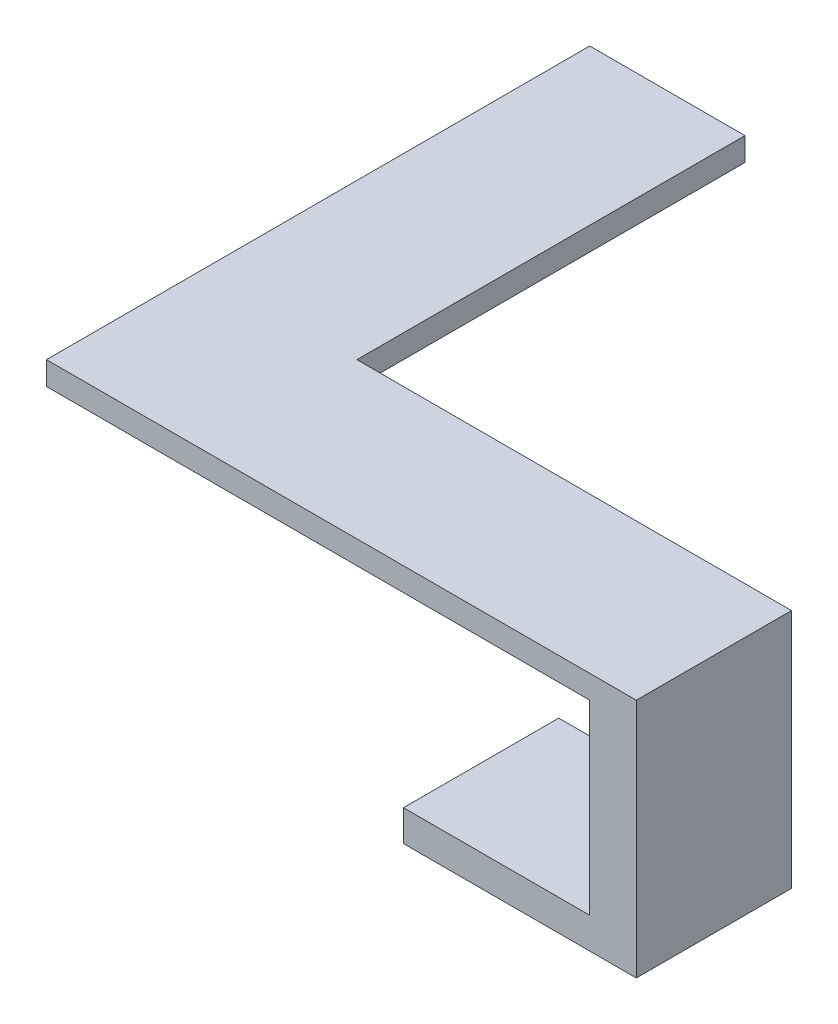
ISO-10303-21;
HEADER;
FILE_DESCRIPTION(('STEP AP214'),'2;1');
FILE_NAME('part.step','',(''),(''),'','','');
FILE_SCHEMA(('AUTOMOTIVE_DESIGN { 1 0 10303 214 1 1 1 1 }'));
ENDSEC;
DATA;
#1=APPLICATION_CONTEXT('core data for automotive mechanical design processes');
#2=APPLICATION_PROTOCOL_DEFINITION('international standard','automotive_design',2000,#1);
#3=PRODUCT_CONTEXT('',#1,'mechanical');
#4=PRODUCT('Part','Part','',(#3));
#5=PRODUCT_RELATED_PRODUCT_CATEGORY('part','',(#4));
#6=PRODUCT_DEFINITION_FORMATION('','',#4);
#7=PRODUCT_DEFINITION_CONTEXT('part definition',#1,'design');
#8=PRODUCT_DEFINITION('design','',#6,#7);
#9=PRODUCT_DEFINITION_SHAPE('','',#8);
#10=(LENGTH_UNIT() NAMED_UNIT(*) SI_UNIT(.MILLI.,.METRE.));
#11=(NAMED_UNIT(*) PLANE_ANGLE_UNIT() SI_UNIT($,.RADIAN.));
#12=(NAMED_UNIT(*) SI_UNIT($,.STERADIAN.) SOLID_ANGLE_UNIT());
#13=UNCERTAINTY_MEASURE_WITH_UNIT(LENGTH_MEASURE(1.E-05),#10,'distance_accuracy_value','');
#14=(GEOMETRIC_REPRESENTATION_CONTEXT(3) GLOBAL_UNCERTAINTY_ASSIGNED_CONTEXT((#13)) GLOBAL_UNIT_ASSIGNED_CONTEXT((#10,
#11,#12)) REPRESENTATION_CONTEXT('',''));
#15=CARTESIAN_POINT('',(0.,0.,0.));
#16=DIRECTION('',(0.,0.,1.));
#17=DIRECTION('',(1.,0.,0.));
#18=AXIS2_PLACEMENT_3D('',#15,#16,#17);
#19=CARTESIAN_POINT('',(14.4710053420667,-14.,6.23964476502383));
#20=DIRECTION('',(1.,0.,0.));
#21=DIRECTION('',(0.,0.,-1.));
#22=AXIS2_PLACEMENT_3D('',#19,#20,#21);
#23=PLANE('',#22);
#24=DIRECTION('',(0.,0.,-1.));
#25=VECTOR('',#24,1.);
#26=CARTESIAN_POINT('',(14.4710053420667,-12.,-3.76035523497617));
#27=LINE('',#26,#25);
#28=CARTESIAN_POINT('',(14.4710053420667,-12.,6.23964476502383));
#29=VERTEX_POINT('',#28);
#30=CARTESIAN_POINT('',(14.4710053420667,-12.,-3.76035523497617));
#31=VERTEX_POINT('',#30);
#32=EDGE_CURVE('E178',#29,#31,#27,.T.);
#33=ORIENTED_EDGE('',*,*,#32,.F.);
#34=DIRECTION('',(0.,1.,0.));
#35=VECTOR('',#34,1.);
#36=CARTESIAN_POINT('',(14.4710053420667,-14.,6.23964476502383));
#37=LINE('',#36,#35);
#38=CARTESIAN_POINT('',(14.4710053420667,0.,6.23964476502383));
#39=VERTEX_POINT('',#38);
#40=EDGE_CURVE('E48',#29,#39,#37,.T.);
#41=ORIENTED_EDGE('',*,*,#40,.T.);
#42=DIRECTION('',(0.,0.,-1.));
#43=VECTOR('',#42,1.);
#44=CARTESIAN_POINT('',(14.4710053420667,0.,6.23964476502383));
#45=LINE('',#44,#43);
#46=CARTESIAN_POINT('',(14.4710053420667,0.,-3.76035523497617));
#47=VERTEX_POINT('',#46);
#48=EDGE_CURVE('E142',#39,#47,#45,.T.);
#49=ORIENTED_EDGE('',*,*,#48,.T.);
#50=DIRECTION('',(0.,1.,0.));
#51=VECTOR('',#50,1.);
#52=CARTESIAN_POINT('',(14.4710053420667,-14.,-3.76035523497617));
#53=LINE('',#52,#51);
#54=EDGE_CURVE('E161',#31,#47,#53,.T.);
#55=ORIENTED_EDGE('',*,*,#54,.F.);
#56=EDGE_LOOP('',(#33,#41,#49,#55));
#57=FACE_BOUND('',#56,.T.);
#58=ADVANCED_FACE('F33',(#57),#23,.F.);
#59=CARTESIAN_POINT('',(17.4710053420667,1.5,6.23964476502383));
#60=DIRECTION('',(-1.,0.,0.));
#61=DIRECTION('',(0.,0.,1.));
#62=AXIS2_PLACEMENT_3D('',#59,#60,#61);
#63=PLANE('',#62);
#64=DIRECTION('',(0.,-1.,0.));
#65=VECTOR('',#64,1.);
#66=CARTESIAN_POINT('',(17.4710053420667,1.5,6.23964476502383));
#67=LINE('',#66,#65);
#68=CARTESIAN_POINT('',(17.4710053420667,1.5,6.23964476502383));
#69=VERTEX_POINT('',#68);
#70=CARTESIAN_POINT('',(17.4710053420667,-14.,6.23964476502383));
#71=VERTEX_POINT('',#70);
#72=EDGE_CURVE('E117',#69,#71,#67,.T.);
#73=ORIENTED_EDGE('',*,*,#72,.T.);
#74=DIRECTION('',(0.,0.,1.));
#75=VECTOR('',#74,1.);
#76=CARTESIAN_POINT('',(17.4710053420667,-14.,6.23964476502383));
#77=LINE('',#76,#75);
#78=CARTESIAN_POINT('',(17.4710053420667,-14.,-3.76035523497617));
#79=VERTEX_POINT('',#78);
#80=EDGE_CURVE('E166',#79,#71,#77,.T.);
#81=ORIENTED_EDGE('',*,*,#80,.F.);
#82=DIRECTION('',(0.,-1.,0.));
#83=VECTOR('',#82,1.);
#84=CARTESIAN_POINT('',(17.4710053420667,1.5,-3.76035523497617));
#85=LINE('',#84,#83);
#86=CARTESIAN_POINT('',(17.4710053420667,1.5,-3.76035523497617));
#87=VERTEX_POINT('',#86);
#88=EDGE_CURVE('E11',#87,#79,#85,.T.);
#89=ORIENTED_EDGE('',*,*,#88,.F.);
#90=DIRECTION('',(0.,0.,-1.));
#91=VECTOR('',#90,1.);
#92=CARTESIAN_POINT('',(17.4710053420667,1.5,6.23964476502383));
#93=LINE('',#92,#91);
#94=EDGE_CURVE('E130',#69,#87,#93,.T.);
#95=ORIENTED_EDGE('',*,*,#94,.F.);
#96=EDGE_LOOP('',(#73,#81,#89,#95));
#97=FACE_BOUND('',#96,.T.);
#98=ADVANCED_FACE('F35',(#97),#63,.F.);
#99=CARTESIAN_POINT('',(-10.5289946579333,1.5,-3.76035523497617));
#100=DIRECTION('',(0.,0.,1.));
#101=DIRECTION('',(1.,0.,0.));
#102=AXIS2_PLACEMENT_3D('',#99,#100,#101);
#103=PLANE('',#102);
#104=ORIENTED_EDGE('',*,*,#88,.T.);
#105=DIRECTION('',(1.,0.,0.));
#106=VECTOR('',#105,1.);
#107=CARTESIAN_POINT('',(17.4710053420667,-14.,-3.76035523497617));
#108=LINE('',#107,#106);
#109=CARTESIAN_POINT('',(2.47100534206673,-14.,-3.76035523497617));
#110=VERTEX_POINT('',#109);
#111=EDGE_CURVE('E164',#110,#79,#108,.T.);
#112=ORIENTED_EDGE('',*,*,#111,.F.);
#113=DIRECTION('',(0.,-1.,0.));
#114=VECTOR('',#113,1.);
#115=CARTESIAN_POINT('',(2.47100534206673,-14.,-3.76035523497617));
#116=LINE('',#115,#114);
#117=CARTESIAN_POINT('',(2.47100534206673,-12.,-3.76035523497617));
#118=VERTEX_POINT('',#117);
#119=EDGE_CURVE('E181',#118,#110,#116,.T.);
#120=ORIENTED_EDGE('',*,*,#119,.F.);
#121=DIRECTION('',(1.,0.,0.));
#122=VECTOR('',#121,1.);
#123=CARTESIAN_POINT('',(2.47100534206673,-12.,-3.76035523497617));
#124=LINE('',#123,#122);
#125=EDGE_CURVE('E174',#118,#31,#124,.T.);
#126=ORIENTED_EDGE('',*,*,#125,.T.);
#127=ORIENTED_EDGE('',*,*,#54,.T.);
#128=DIRECTION('',(-1.,0.,0.));
#129=VECTOR('',#128,1.);
#130=CARTESIAN_POINT('',(-10.5289946579333,0.,-3.76035523497617));
#131=LINE('',#130,#129);
#132=CARTESIAN_POINT('',(-10.5289946579333,0.,-3.76035523497617));
#133=VERTEX_POINT('',#132);
#134=EDGE_CURVE('E121',#47,#133,#131,.T.);
#135=ORIENTED_EDGE('',*,*,#134,.T.);
#136=DIRECTION('',(0.,-1.,0.));
#137=VECTOR('',#136,1.);
#138=CARTESIAN_POINT('',(-10.5289946579333,1.5,-3.76035523497617));
#139=LINE('',#138,#137);
#140=CARTESIAN_POINT('',(-10.5289946579333,1.5,-3.76035523497617));
#141=VERTEX_POINT('',#140);
#142=EDGE_CURVE('E41',#141,#133,#139,.T.);
#143=ORIENTED_EDGE('',*,*,#142,.F.);
#144=DIRECTION('',(-1.,0.,0.));
#145=VECTOR('',#144,1.);
#146=CARTESIAN_POINT('',(-10.5289946579333,1.5,-3.76035523497617));
#147=LINE('',#146,#145);
#148=EDGE_CURVE('E87',#87,#141,#147,.T.);
#149=ORIENTED_EDGE('',*,*,#148,.F.);
#150=EDGE_LOOP('',(#104,#112,#120,#126,#127,#135,#143,#149));
#151=FACE_BOUND('',#150,.T.);
#152=ADVANCED_FACE('F203',(#151),#103,.F.);
#153=CARTESIAN_POINT('',(-10.5289946579333,1.5,-3.76035523497617));
#154=DIRECTION('',(-1.,0.,0.));
#155=DIRECTION('',(0.,0.,1.));
#156=AXIS2_PLACEMENT_3D('',#153,#154,#155);
#157=PLANE('',#156);
#158=DIRECTION('',(0.,0.,-1.));
#159=VECTOR('',#158,1.);
#160=CARTESIAN_POINT('',(-10.5289946579333,0.,-3.76035523497617));
#161=LINE('',#160,#159);
#162=CARTESIAN_POINT('',(-10.528994657933,0.,-28.7603552349762));
#163=VERTEX_POINT('',#162);
#164=EDGE_CURVE('E123',#133,#163,#161,.T.);
#165=ORIENTED_EDGE('',*,*,#164,.T.);
#166=DIRECTION('',(0.,-1.,0.));
#167=VECTOR('',#166,1.);
#168=CARTESIAN_POINT('',(-10.528994657933,1.5,-28.7603552349762));
#169=LINE('',#168,#167);
#170=CARTESIAN_POINT('',(-10.528994657933,1.5,-28.7603552349762));
#171=VERTEX_POINT('',#170);
#172=EDGE_CURVE('E112',#171,#163,#169,.T.);
#173=ORIENTED_EDGE('',*,*,#172,.F.);
#174=DIRECTION('',(0.,0.,-1.));
#175=VECTOR('',#174,1.);
#176=CARTESIAN_POINT('',(-10.5289946579333,1.5,-3.76035523497617));
#177=LINE('',#176,#175);
#178=EDGE_CURVE('E103',#141,#171,#177,.T.);
#179=ORIENTED_EDGE('',*,*,#178,.F.);
#180=ORIENTED_EDGE('',*,*,#142,.T.);
#181=EDGE_LOOP('',(#165,#173,#179,#180));
#182=FACE_BOUND('',#181,.T.);
#183=ADVANCED_FACE('F137',(#182),#157,.F.);
#184=CARTESIAN_POINT('',(-10.528994657933,1.5,-28.7603552349762));
#185=DIRECTION('',(0.,0.,1.));
#186=DIRECTION('',(1.,0.,0.));
#187=AXIS2_PLACEMENT_3D('',#184,#185,#186);
#188=PLANE('',#187);
#189=DIRECTION('',(-1.,0.,0.));
#190=VECTOR('',#189,1.);
#191=CARTESIAN_POINT('',(-10.528994657933,0.,-28.7603552349762));
#192=LINE('',#191,#190);
#193=CARTESIAN_POINT('',(-20.528994657933,0.,-28.7603552349763));
#194=VERTEX_POINT('',#193);
#195=EDGE_CURVE('E111',#163,#194,#192,.T.);
#196=ORIENTED_EDGE('',*,*,#195,.T.);
#197=DIRECTION('',(0.,-1.,0.));
#198=VECTOR('',#197,1.);
#199=CARTESIAN_POINT('',(-20.528994657933,1.5,-28.7603552349763));
#200=LINE('',#199,#198);
#201=CARTESIAN_POINT('',(-20.528994657933,1.5,-28.7603552349763));
#202=VERTEX_POINT('',#201);
#203=EDGE_CURVE('E108',#202,#194,#200,.T.);
#204=ORIENTED_EDGE('',*,*,#203,.F.);
#205=DIRECTION('',(-1.,0.,0.));
#206=VECTOR('',#205,1.);
#207=CARTESIAN_POINT('',(-10.528994657933,1.5,-28.7603552349762));
#208=LINE('',#207,#206);
#209=EDGE_CURVE('E97',#171,#202,#208,.T.);
#210=ORIENTED_EDGE('',*,*,#209,.F.);
#211=ORIENTED_EDGE('',*,*,#172,.T.);
#212=EDGE_LOOP('',(#196,#204,#210,#211));
#213=FACE_BOUND('',#212,.T.);
#214=ADVANCED_FACE('F109',(#213),#188,.F.);
#215=CARTESIAN_POINT('',(-20.528994657933,1.5,-28.7603552349763));
#216=DIRECTION('',(1.,0.,0.));
#217=DIRECTION('',(0.,0.,-1.));
#218=AXIS2_PLACEMENT_3D('',#215,#216,#217);
#219=PLANE('',#218);
#220=DIRECTION('',(0.,0.,1.));
#221=VECTOR('',#220,1.);
#222=CARTESIAN_POINT('',(-20.528994657933,0.,-28.7603552349763));
#223=LINE('',#222,#221);
#224=CARTESIAN_POINT('',(-20.5289946579334,0.,6.23964476502383));
#225=VERTEX_POINT('',#224);
#226=EDGE_CURVE('E79',#194,#225,#223,.T.);
#227=ORIENTED_EDGE('',*,*,#226,.T.);
#228=DIRECTION('',(0.,-1.,0.));
#229=VECTOR('',#228,1.);
#230=CARTESIAN_POINT('',(-20.5289946579334,1.5,6.23964476502383));
#231=LINE('',#230,#229);
#232=CARTESIAN_POINT('',(-20.5289946579334,1.5,6.23964476502383));
#233=VERTEX_POINT('',#232);
#234=EDGE_CURVE('E113',#233,#225,#231,.T.);
#235=ORIENTED_EDGE('',*,*,#234,.F.);
#236=DIRECTION('',(0.,0.,1.));
#237=VECTOR('',#236,1.);
#238=CARTESIAN_POINT('',(-20.528994657933,1.5,-28.7603552349763));
#239=LINE('',#238,#237);
#240=EDGE_CURVE('E101',#202,#233,#239,.T.);
#241=ORIENTED_EDGE('',*,*,#240,.F.);
#242=ORIENTED_EDGE('',*,*,#203,.T.);
#243=EDGE_LOOP('',(#227,#235,#241,#242));
#244=FACE_BOUND('',#243,.T.);
#245=ADVANCED_FACE('F115',(#244),#219,.F.);
#246=CARTESIAN_POINT('',(-20.5289946579334,1.5,6.23964476502383));
#247=DIRECTION('',(0.,0.,-1.));
#248=DIRECTION('',(-1.,0.,0.));
#249=AXIS2_PLACEMENT_3D('',#246,#247,#248);
#250=PLANE('',#249);
#251=DIRECTION('',(1.,0.,0.));
#252=VECTOR('',#251,1.);
#253=CARTESIAN_POINT('',(-20.5289946579334,0.,6.23964476502383));
#254=LINE('',#253,#252);
#255=EDGE_CURVE('E127',#225,#39,#254,.T.);
#256=ORIENTED_EDGE('',*,*,#255,.T.);
#257=ORIENTED_EDGE('',*,*,#40,.F.);
#258=DIRECTION('',(1.,0.,0.));
#259=VECTOR('',#258,1.);
#260=CARTESIAN_POINT('',(2.47100534206673,-12.,6.23964476502383));
#261=LINE('',#260,#259);
#262=CARTESIAN_POINT('',(2.47100534206673,-12.,6.23964476502383));
#263=VERTEX_POINT('',#262);
#264=EDGE_CURVE('E167',#263,#29,#261,.T.);
#265=ORIENTED_EDGE('',*,*,#264,.F.);
#266=DIRECTION('',(0.,1.,0.));
#267=VECTOR('',#266,1.);
#268=CARTESIAN_POINT('',(2.47100534206673,-14.,6.23964476502383));
#269=LINE('',#268,#267);
#270=CARTESIAN_POINT('',(2.47100534206673,-14.,6.23964476502383));
#271=VERTEX_POINT('',#270);
#272=EDGE_CURVE('E184',#271,#263,#269,.T.);
#273=ORIENTED_EDGE('',*,*,#272,.F.);
#274=DIRECTION('',(-1.,0.,0.));
#275=VECTOR('',#274,1.);
#276=CARTESIAN_POINT('',(17.4710053420667,-14.,6.23964476502383));
#277=LINE('',#276,#275);
#278=EDGE_CURVE('E152',#71,#271,#277,.T.);
#279=ORIENTED_EDGE('',*,*,#278,.F.);
#280=ORIENTED_EDGE('',*,*,#72,.F.);
#281=DIRECTION('',(1.,0.,0.));
#282=VECTOR('',#281,1.);
#283=CARTESIAN_POINT('',(-20.5289946579334,1.5,6.23964476502383));
#284=LINE('',#283,#282);
#285=EDGE_CURVE('E57',#233,#69,#284,.T.);
#286=ORIENTED_EDGE('',*,*,#285,.F.);
#287=ORIENTED_EDGE('',*,*,#234,.T.);
#288=EDGE_LOOP('',(#256,#257,#265,#273,#279,#280,#286,#287));
#289=FACE_BOUND('',#288,.T.);
#290=ADVANCED_FACE('F144',(#289),#250,.F.);
#291=CARTESIAN_POINT('',(0.,1.5,0.));
#292=DIRECTION('',(0.,-1.,0.));
#293=DIRECTION('',(0.,0.,-1.));
#294=AXIS2_PLACEMENT_3D('',#291,#292,#293);
#295=PLANE('',#294);
#296=ORIENTED_EDGE('',*,*,#94,.T.);
#297=ORIENTED_EDGE('',*,*,#148,.T.);
#298=ORIENTED_EDGE('',*,*,#178,.T.);
#299=ORIENTED_EDGE('',*,*,#209,.T.);
#300=ORIENTED_EDGE('',*,*,#240,.T.);
#301=ORIENTED_EDGE('',*,*,#285,.T.);
#302=EDGE_LOOP('',(#296,#297,#298,#299,#300,#301));
#303=FACE_BOUND('',#302,.T.);
#304=ADVANCED_FACE('F99',(#303),#295,.F.);
#305=CARTESIAN_POINT('',(0.,0.,0.));
#306=DIRECTION('',(0.,-1.,0.));
#307=DIRECTION('',(0.,0.,-1.));
#308=AXIS2_PLACEMENT_3D('',#305,#306,#307);
#309=PLANE('',#308);
#310=ORIENTED_EDGE('',*,*,#48,.F.);
#311=ORIENTED_EDGE('',*,*,#255,.F.);
#312=ORIENTED_EDGE('',*,*,#226,.F.);
#313=ORIENTED_EDGE('',*,*,#195,.F.);
#314=ORIENTED_EDGE('',*,*,#164,.F.);
#315=ORIENTED_EDGE('',*,*,#134,.F.);
#316=EDGE_LOOP('',(#310,#311,#312,#313,#314,#315));
#317=FACE_BOUND('',#316,.T.);
#318=ADVANCED_FACE('F140',(#317),#309,.T.);
#319=CARTESIAN_POINT('',(0.,-14.,0.));
#320=DIRECTION('',(0.,1.,0.));
#321=DIRECTION('',(0.,0.,1.));
#322=AXIS2_PLACEMENT_3D('',#319,#320,#321);
#323=PLANE('',#322);
#324=ORIENTED_EDGE('',*,*,#80,.T.);
#325=ORIENTED_EDGE('',*,*,#278,.T.);
#326=DIRECTION('',(0.,0.,1.));
#327=VECTOR('',#326,1.);
#328=CARTESIAN_POINT('',(2.47100534206673,-14.,-3.76035523497617));
#329=LINE('',#328,#327);
#330=EDGE_CURVE('E187',#110,#271,#329,.T.);
#331=ORIENTED_EDGE('',*,*,#330,.F.);
#332=ORIENTED_EDGE('',*,*,#111,.T.);
#333=EDGE_LOOP('',(#324,#325,#331,#332));
#334=FACE_BOUND('',#333,.T.);
#335=ADVANCED_FACE('F213',(#334),#323,.F.);
#336=CARTESIAN_POINT('',(2.47100534206673,-12.,-3.76035523497617));
#337=DIRECTION('',(0.,-1.,0.));
#338=DIRECTION('',(0.,0.,-1.));
#339=AXIS2_PLACEMENT_3D('',#336,#337,#338);
#340=PLANE('',#339);
#341=ORIENTED_EDGE('',*,*,#32,.T.);
#342=ORIENTED_EDGE('',*,*,#125,.F.);
#343=DIRECTION('',(0.,0.,-1.));
#344=VECTOR('',#343,1.);
#345=CARTESIAN_POINT('',(2.47100534206673,-12.,-3.76035523497617));
#346=LINE('',#345,#344);
#347=EDGE_CURVE('E177',#263,#118,#346,.T.);
#348=ORIENTED_EDGE('',*,*,#347,.F.);
#349=ORIENTED_EDGE('',*,*,#264,.T.);
#350=EDGE_LOOP('',(#341,#342,#348,#349));
#351=FACE_BOUND('',#350,.T.);
#352=ADVANCED_FACE('F215',(#351),#340,.F.);
#353=CARTESIAN_POINT('',(2.47100534206673,0.,0.));
#354=DIRECTION('',(1.,0.,0.));
#355=DIRECTION('',(0.,0.,-1.));
#356=AXIS2_PLACEMENT_3D('',#353,#354,#355);
#357=PLANE('',#356);
#358=ORIENTED_EDGE('',*,*,#119,.T.);
#359=ORIENTED_EDGE('',*,*,#330,.T.);
#360=ORIENTED_EDGE('',*,*,#272,.T.);
#361=ORIENTED_EDGE('',*,*,#347,.T.);
#362=EDGE_LOOP('',(#358,#359,#360,#361));
#363=FACE_BOUND('',#362,.T.);
#364=ADVANCED_FACE('F194',(#363),#357,.F.);
#365=CLOSED_SHELL('',(#58,#98,#152,#183,#214,#245,#290,#304,#318,#335,#352,#364));
#366=MANIFOLD_SOLID_BREP('B2',#365);
#367=ADVANCED_BREP_SHAPE_REPRESENTATION('',(#18,#366),#14);
#368=SHAPE_DEFINITION_REPRESENTATION(#9,#367);
ENDSEC;
END-ISO-10303-21;
